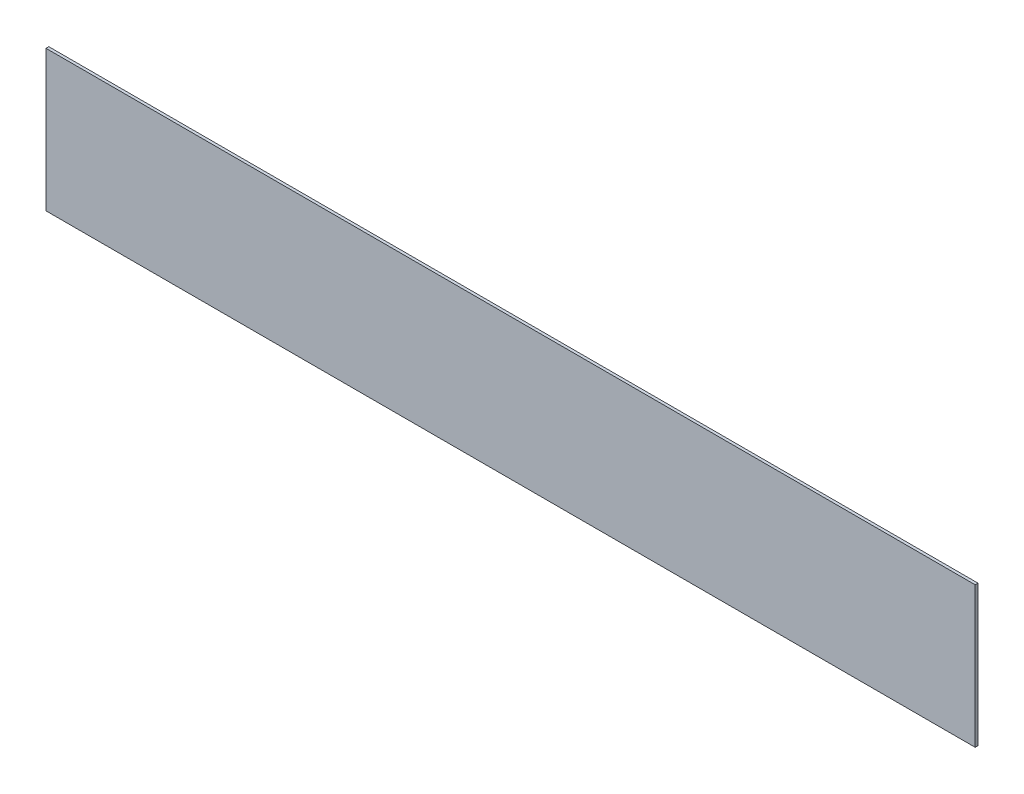
ISO-10303-21;
HEADER;
FILE_DESCRIPTION(('STEP AP214'),'2;1');
FILE_NAME('part.step','',(''),(''),'','','');
FILE_SCHEMA(('AUTOMOTIVE_DESIGN { 1 0 10303 214 1 1 1 1 }'));
ENDSEC;
DATA;
#1=APPLICATION_CONTEXT('core data for automotive mechanical design processes');
#2=APPLICATION_PROTOCOL_DEFINITION('international standard','automotive_design',2000,#1);
#3=PRODUCT_CONTEXT('',#1,'mechanical');
#4=PRODUCT('Part','Part','',(#3));
#5=PRODUCT_RELATED_PRODUCT_CATEGORY('part','',(#4));
#6=PRODUCT_DEFINITION_FORMATION('','',#4);
#7=PRODUCT_DEFINITION_CONTEXT('part definition',#1,'design');
#8=PRODUCT_DEFINITION('design','',#6,#7);
#9=PRODUCT_DEFINITION_SHAPE('','',#8);
#10=(LENGTH_UNIT() NAMED_UNIT(*) SI_UNIT(.MILLI.,.METRE.));
#11=(NAMED_UNIT(*) PLANE_ANGLE_UNIT() SI_UNIT($,.RADIAN.));
#12=(NAMED_UNIT(*) SI_UNIT($,.STERADIAN.) SOLID_ANGLE_UNIT());
#13=UNCERTAINTY_MEASURE_WITH_UNIT(LENGTH_MEASURE(1.E-05),#10,'distance_accuracy_value','');
#14=(GEOMETRIC_REPRESENTATION_CONTEXT(3) GLOBAL_UNCERTAINTY_ASSIGNED_CONTEXT((#13)) GLOBAL_UNIT_ASSIGNED_CONTEXT((#10,
#11,#12)) REPRESENTATION_CONTEXT('',''));
#15=CARTESIAN_POINT('',(0.,0.,0.));
#16=DIRECTION('',(0.,0.,1.));
#17=DIRECTION('',(1.,0.,0.));
#18=AXIS2_PLACEMENT_3D('',#15,#16,#17);
#19=CARTESIAN_POINT('',(16.5,-2.5,0.1));
#20=DIRECTION('',(-1.,0.,0.));
#21=DIRECTION('',(0.,0.,1.));
#22=AXIS2_PLACEMENT_3D('',#19,#20,#21);
#23=PLANE('',#22);
#24=DIRECTION('',(0.,1.,0.));
#25=VECTOR('',#24,1.);
#26=CARTESIAN_POINT('',(16.5,-2.5,0.));
#27=LINE('',#26,#25);
#28=CARTESIAN_POINT('',(16.5,-2.5,0.));
#29=VERTEX_POINT('',#28);
#30=CARTESIAN_POINT('',(16.5,2.5,0.));
#31=VERTEX_POINT('',#30);
#32=EDGE_CURVE('E99',#29,#31,#27,.T.);
#33=ORIENTED_EDGE('',*,*,#32,.T.);
#34=DIRECTION('',(0.,0.,-1.));
#35=VECTOR('',#34,1.);
#36=CARTESIAN_POINT('',(16.5,2.5,0.1));
#37=LINE('',#36,#35);
#38=CARTESIAN_POINT('',(16.5,2.5,0.1));
#39=VERTEX_POINT('',#38);
#40=EDGE_CURVE('E11',#39,#31,#37,.T.);
#41=ORIENTED_EDGE('',*,*,#40,.F.);
#42=DIRECTION('',(0.,1.,0.));
#43=VECTOR('',#42,1.);
#44=CARTESIAN_POINT('',(16.5,-2.5,0.1));
#45=LINE('',#44,#43);
#46=CARTESIAN_POINT('',(16.5,-2.5,0.1));
#47=VERTEX_POINT('',#46);
#48=EDGE_CURVE('E87',#47,#39,#45,.T.);
#49=ORIENTED_EDGE('',*,*,#48,.F.);
#50=DIRECTION('',(0.,0.,-1.));
#51=VECTOR('',#50,1.);
#52=CARTESIAN_POINT('',(16.5,-2.5,0.1));
#53=LINE('',#52,#51);
#54=EDGE_CURVE('E95',#47,#29,#53,.T.);
#55=ORIENTED_EDGE('',*,*,#54,.T.);
#56=EDGE_LOOP('',(#33,#41,#49,#55));
#57=FACE_BOUND('',#56,.T.);
#58=ADVANCED_FACE('F36',(#57),#23,.F.);
#59=CARTESIAN_POINT('',(-16.5,2.5,0.1));
#60=DIRECTION('',(0.,-1.,0.));
#61=DIRECTION('',(0.,0.,-1.));
#62=AXIS2_PLACEMENT_3D('',#59,#60,#61);
#63=PLANE('',#62);
#64=DIRECTION('',(-1.,0.,0.));
#65=VECTOR('',#64,1.);
#66=CARTESIAN_POINT('',(-16.5,2.5,0.));
#67=LINE('',#66,#65);
#68=CARTESIAN_POINT('',(-16.5,2.5,0.));
#69=VERTEX_POINT('',#68);
#70=EDGE_CURVE('E91',#31,#69,#67,.T.);
#71=ORIENTED_EDGE('',*,*,#70,.T.);
#72=DIRECTION('',(0.,0.,-1.));
#73=VECTOR('',#72,1.);
#74=CARTESIAN_POINT('',(-16.5,2.5,0.1));
#75=LINE('',#74,#73);
#76=CARTESIAN_POINT('',(-16.5,2.5,0.1));
#77=VERTEX_POINT('',#76);
#78=EDGE_CURVE('E44',#77,#69,#75,.T.);
#79=ORIENTED_EDGE('',*,*,#78,.F.);
#80=DIRECTION('',(-1.,0.,0.));
#81=VECTOR('',#80,1.);
#82=CARTESIAN_POINT('',(-16.5,2.5,0.1));
#83=LINE('',#82,#81);
#84=EDGE_CURVE('E82',#39,#77,#83,.T.);
#85=ORIENTED_EDGE('',*,*,#84,.F.);
#86=ORIENTED_EDGE('',*,*,#40,.T.);
#87=EDGE_LOOP('',(#71,#79,#85,#86));
#88=FACE_BOUND('',#87,.T.);
#89=ADVANCED_FACE('F90',(#88),#63,.F.);
#90=CARTESIAN_POINT('',(-16.5,-2.5,0.1));
#91=DIRECTION('',(1.,0.,0.));
#92=DIRECTION('',(0.,0.,-1.));
#93=AXIS2_PLACEMENT_3D('',#90,#91,#92);
#94=PLANE('',#93);
#95=DIRECTION('',(0.,-1.,0.));
#96=VECTOR('',#95,1.);
#97=CARTESIAN_POINT('',(-16.5,-2.5,0.));
#98=LINE('',#97,#96);
#99=CARTESIAN_POINT('',(-16.5,-2.5,0.));
#100=VERTEX_POINT('',#99);
#101=EDGE_CURVE('E69',#69,#100,#98,.T.);
#102=ORIENTED_EDGE('',*,*,#101,.T.);
#103=DIRECTION('',(0.,0.,-1.));
#104=VECTOR('',#103,1.);
#105=CARTESIAN_POINT('',(-16.5,-2.5,0.1));
#106=LINE('',#105,#104);
#107=CARTESIAN_POINT('',(-16.5,-2.5,0.1));
#108=VERTEX_POINT('',#107);
#109=EDGE_CURVE('E92',#108,#100,#106,.T.);
#110=ORIENTED_EDGE('',*,*,#109,.F.);
#111=DIRECTION('',(0.,-1.,0.));
#112=VECTOR('',#111,1.);
#113=CARTESIAN_POINT('',(-16.5,-2.5,0.1));
#114=LINE('',#113,#112);
#115=EDGE_CURVE('E85',#77,#108,#114,.T.);
#116=ORIENTED_EDGE('',*,*,#115,.F.);
#117=ORIENTED_EDGE('',*,*,#78,.T.);
#118=EDGE_LOOP('',(#102,#110,#116,#117));
#119=FACE_BOUND('',#118,.T.);
#120=ADVANCED_FACE('F93',(#119),#94,.F.);
#121=CARTESIAN_POINT('',(-16.5,-2.5,0.1));
#122=DIRECTION('',(0.,1.,0.));
#123=DIRECTION('',(0.,0.,1.));
#124=AXIS2_PLACEMENT_3D('',#121,#122,#123);
#125=PLANE('',#124);
#126=DIRECTION('',(1.,0.,0.));
#127=VECTOR('',#126,1.);
#128=CARTESIAN_POINT('',(-16.5,-2.5,0.));
#129=LINE('',#128,#127);
#130=EDGE_CURVE('E75',#100,#29,#129,.T.);
#131=ORIENTED_EDGE('',*,*,#130,.T.);
#132=ORIENTED_EDGE('',*,*,#54,.F.);
#133=DIRECTION('',(1.,0.,0.));
#134=VECTOR('',#133,1.);
#135=CARTESIAN_POINT('',(-16.5,-2.5,0.1));
#136=LINE('',#135,#134);
#137=EDGE_CURVE('E52',#108,#47,#136,.T.);
#138=ORIENTED_EDGE('',*,*,#137,.F.);
#139=ORIENTED_EDGE('',*,*,#109,.T.);
#140=EDGE_LOOP('',(#131,#132,#138,#139));
#141=FACE_BOUND('',#140,.T.);
#142=ADVANCED_FACE('F106',(#141),#125,.F.);
#143=CARTESIAN_POINT('',(0.,0.,0.1));
#144=DIRECTION('',(0.,0.,-1.));
#145=DIRECTION('',(-1.,0.,0.));
#146=AXIS2_PLACEMENT_3D('',#143,#144,#145);
#147=PLANE('',#146);
#148=ORIENTED_EDGE('',*,*,#48,.T.);
#149=ORIENTED_EDGE('',*,*,#84,.T.);
#150=ORIENTED_EDGE('',*,*,#115,.T.);
#151=ORIENTED_EDGE('',*,*,#137,.T.);
#152=EDGE_LOOP('',(#148,#149,#150,#151));
#153=FACE_BOUND('',#152,.T.);
#154=ADVANCED_FACE('F83',(#153),#147,.F.);
#155=CARTESIAN_POINT('',(0.,0.,0.));
#156=DIRECTION('',(0.,0.,-1.));
#157=DIRECTION('',(-1.,0.,0.));
#158=AXIS2_PLACEMENT_3D('',#155,#156,#157);
#159=PLANE('',#158);
#160=ORIENTED_EDGE('',*,*,#32,.F.);
#161=ORIENTED_EDGE('',*,*,#130,.F.);
#162=ORIENTED_EDGE('',*,*,#101,.F.);
#163=ORIENTED_EDGE('',*,*,#70,.F.);
#164=EDGE_LOOP('',(#160,#161,#162,#163));
#165=FACE_BOUND('',#164,.T.);
#166=ADVANCED_FACE('F109',(#165),#159,.T.);
#167=CLOSED_SHELL('',(#58,#89,#120,#142,#154,#166));
#168=MANIFOLD_SOLID_BREP('B2',#167);
#169=ADVANCED_BREP_SHAPE_REPRESENTATION('',(#18,#168),#14);
#170=SHAPE_DEFINITION_REPRESENTATION(#9,#169);
ENDSEC;
END-ISO-10303-21;
